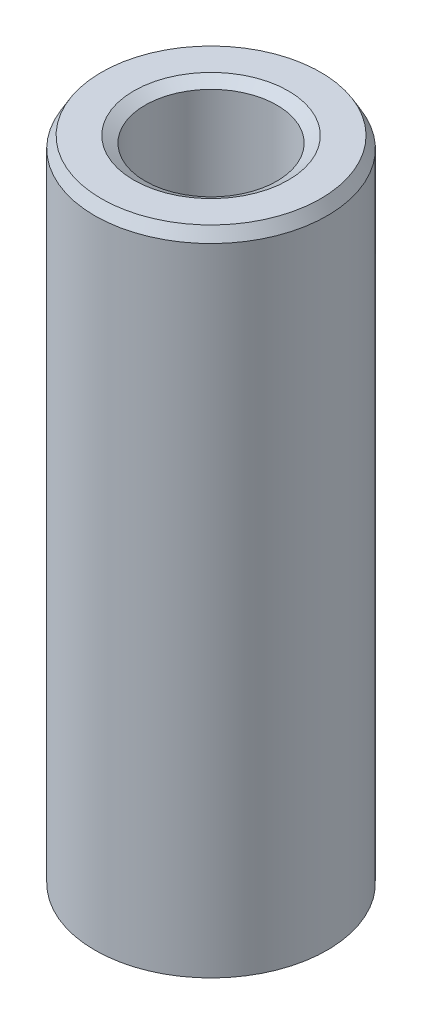
ISO-10303-21;
HEADER;
FILE_DESCRIPTION(('STEP AP214'),'2;1');
FILE_NAME('part.step','',(''),(''),'','','');
FILE_SCHEMA(('AUTOMOTIVE_DESIGN { 1 0 10303 214 1 1 1 1 }'));
ENDSEC;
DATA;
#1=APPLICATION_CONTEXT('core data for automotive mechanical design processes');
#2=APPLICATION_PROTOCOL_DEFINITION('international standard','automotive_design',2000,#1);
#3=PRODUCT_CONTEXT('',#1,'mechanical');
#4=PRODUCT('Part','Part','',(#3));
#5=PRODUCT_RELATED_PRODUCT_CATEGORY('part','',(#4));
#6=PRODUCT_DEFINITION_FORMATION('','',#4);
#7=PRODUCT_DEFINITION_CONTEXT('part definition',#1,'design');
#8=PRODUCT_DEFINITION('design','',#6,#7);
#9=PRODUCT_DEFINITION_SHAPE('','',#8);
#10=(LENGTH_UNIT() NAMED_UNIT(*) SI_UNIT(.MILLI.,.METRE.));
#11=(NAMED_UNIT(*) PLANE_ANGLE_UNIT() SI_UNIT($,.RADIAN.));
#12=(NAMED_UNIT(*) SI_UNIT($,.STERADIAN.) SOLID_ANGLE_UNIT());
#13=UNCERTAINTY_MEASURE_WITH_UNIT(LENGTH_MEASURE(1.E-05),#10,'distance_accuracy_value','');
#14=(GEOMETRIC_REPRESENTATION_CONTEXT(3) GLOBAL_UNCERTAINTY_ASSIGNED_CONTEXT((#13)) GLOBAL_UNIT_ASSIGNED_CONTEXT((#10,
#11,#12)) REPRESENTATION_CONTEXT('',''));
#15=CARTESIAN_POINT('',(0.,0.,0.));
#16=DIRECTION('',(0.,0.,1.));
#17=DIRECTION('',(1.,0.,0.));
#18=AXIS2_PLACEMENT_3D('',#15,#16,#17);
#19=CARTESIAN_POINT('',(0.,140.711096177235,0.));
#20=DIRECTION('',(0.,-1.,0.));
#21=DIRECTION('',(0.,0.,-1.));
#22=AXIS2_PLACEMENT_3D('',#19,#20,#21);
#23=CYLINDRICAL_SURFACE('',#22,25.);
#24=CARTESIAN_POINT('',(0.,1.42008506931526,0.));
#25=DIRECTION('',(0.,1.,0.));
#26=DIRECTION('',(0.,0.,1.));
#27=AXIS2_PLACEMENT_3D('',#24,#25,#26);
#28=CIRCLE('',#27,25.);
#29=CARTESIAN_POINT('',(0.,1.42008506931526,25.));
#30=VERTEX_POINT('',#29);
#31=EDGE_CURVE('E10',#30,#30,#28,.T.);
#32=ORIENTED_EDGE('',*,*,#31,.T.);
#33=EDGE_LOOP('',(#32));
#34=FACE_BOUND('',#33,.T.);
#35=CARTESIAN_POINT('',(0.,138.251436686111,0.));
#36=DIRECTION('',(0.,1.,0.));
#37=DIRECTION('',(0.,0.,1.));
#38=AXIS2_PLACEMENT_3D('',#35,#36,#37);
#39=CIRCLE('',#38,25.);
#40=CARTESIAN_POINT('',(0.,138.251436686111,25.));
#41=VERTEX_POINT('',#40);
#42=EDGE_CURVE('E50',#41,#41,#39,.F.);
#43=ORIENTED_EDGE('',*,*,#42,.T.);
#44=EDGE_LOOP('',(#43));
#45=FACE_BOUND('',#44,.T.);
#46=ADVANCED_FACE('F39',(#34,#45),#23,.T.);
#47=CARTESIAN_POINT('',(0.,140.711096177235,0.));
#48=DIRECTION('',(0.,1.,0.));
#49=DIRECTION('',(0.,0.,1.));
#50=AXIS2_PLACEMENT_3D('',#47,#48,#49);
#51=PLANE('',#50);
#52=CARTESIAN_POINT('',(0.,140.711096177235,0.));
#53=DIRECTION('',(0.,1.,0.));
#54=DIRECTION('',(0.,0.,1.));
#55=AXIS2_PLACEMENT_3D('',#52,#53,#54);
#56=CIRCLE('',#55,16.6314569226916);
#57=CARTESIAN_POINT('',(0.,140.711096177235,16.6314569226916));
#58=VERTEX_POINT('',#57);
#59=EDGE_CURVE('E58',#58,#58,#56,.F.);
#60=ORIENTED_EDGE('',*,*,#59,.T.);
#61=EDGE_LOOP('',(#60));
#62=FACE_BOUND('',#61,.T.);
#63=CARTESIAN_POINT('',(0.,140.711096177235,0.));
#64=DIRECTION('',(0.,1.,0.));
#65=DIRECTION('',(0.,0.,1.));
#66=AXIS2_PLACEMENT_3D('',#63,#64,#65);
#67=CIRCLE('',#66,23.5799149306848);
#68=CARTESIAN_POINT('',(0.,140.711096177235,23.5799149306848));
#69=VERTEX_POINT('',#68);
#70=EDGE_CURVE('E61',#69,#69,#67,.T.);
#71=ORIENTED_EDGE('',*,*,#70,.T.);
#72=EDGE_LOOP('',(#71));
#73=FACE_BOUND('',#72,.T.);
#74=ADVANCED_FACE('F88',(#62,#73),#51,.T.);
#75=CARTESIAN_POINT('',(0.,0.,0.));
#76=DIRECTION('',(0.,1.,0.));
#77=DIRECTION('',(0.,0.,1.));
#78=AXIS2_PLACEMENT_3D('',#75,#76,#77);
#79=PLANE('',#78);
#80=CARTESIAN_POINT('',(0.,0.,0.));
#81=DIRECTION('',(0.,1.,0.));
#82=DIRECTION('',(0.,0.,1.));
#83=AXIS2_PLACEMENT_3D('',#80,#81,#82);
#84=CIRCLE('',#83,15.5918825008829);
#85=CARTESIAN_POINT('',(0.,0.,15.5918825008829));
#86=VERTEX_POINT('',#85);
#87=EDGE_CURVE('E51',#86,#86,#84,.T.);
#88=ORIENTED_EDGE('',*,*,#87,.T.);
#89=EDGE_LOOP('',(#88));
#90=FACE_BOUND('',#89,.T.);
#91=CARTESIAN_POINT('',(0.,0.,0.));
#92=DIRECTION('',(0.,1.,0.));
#93=DIRECTION('',(0.,0.,1.));
#94=AXIS2_PLACEMENT_3D('',#91,#92,#93);
#95=CIRCLE('',#94,22.540340508876);
#96=CARTESIAN_POINT('',(0.,0.,22.540340508876));
#97=VERTEX_POINT('',#96);
#98=EDGE_CURVE('E54',#97,#97,#95,.F.);
#99=ORIENTED_EDGE('',*,*,#98,.T.);
#100=EDGE_LOOP('',(#99));
#101=FACE_BOUND('',#100,.T.);
#102=ADVANCED_FACE('F83',(#90,#101),#79,.F.);
#103=CARTESIAN_POINT('',(0.,140.711096177235,0.));
#104=DIRECTION('',(0.,-1.,0.));
#105=DIRECTION('',(0.,0.,-1.));
#106=AXIS2_PLACEMENT_3D('',#103,#104,#105);
#107=CYLINDRICAL_SURFACE('',#106,14.1717974315676);
#108=CARTESIAN_POINT('',(0.,139.29101110792,0.));
#109=DIRECTION('',(0.,1.,0.));
#110=DIRECTION('',(0.,0.,1.));
#111=AXIS2_PLACEMENT_3D('',#108,#109,#110);
#112=CIRCLE('',#111,14.1717974315676);
#113=CARTESIAN_POINT('',(0.,139.29101110792,14.1717974315676));
#114=VERTEX_POINT('',#113);
#115=EDGE_CURVE('E67',#114,#114,#112,.T.);
#116=ORIENTED_EDGE('',*,*,#115,.T.);
#117=EDGE_LOOP('',(#116));
#118=FACE_BOUND('',#117,.T.);
#119=CARTESIAN_POINT('',(0.,2.45965949112401,0.));
#120=DIRECTION('',(0.,1.,0.));
#121=DIRECTION('',(0.,0.,1.));
#122=AXIS2_PLACEMENT_3D('',#119,#120,#121);
#123=CIRCLE('',#122,14.1717974315676);
#124=CARTESIAN_POINT('',(0.,2.45965949112401,14.1717974315676));
#125=VERTEX_POINT('',#124);
#126=EDGE_CURVE('E69',#125,#125,#123,.F.);
#127=ORIENTED_EDGE('',*,*,#126,.T.);
#128=EDGE_LOOP('',(#127));
#129=FACE_BOUND('',#128,.T.);
#130=ADVANCED_FACE('F71',(#118,#129),#107,.F.);
#131=CARTESIAN_POINT('',(0.,139.29101110792,0.));
#132=DIRECTION('',(0.,1.,0.));
#133=DIRECTION('',(0.,0.,1.));
#134=AXIS2_PLACEMENT_3D('',#131,#132,#133);
#135=CONICAL_SURFACE('',#134,14.1717974315676,1.04719755119659);
#136=ORIENTED_EDGE('',*,*,#59,.F.);
#137=EDGE_LOOP('',(#136));
#138=FACE_BOUND('',#137,.T.);
#139=ORIENTED_EDGE('',*,*,#115,.F.);
#140=EDGE_LOOP('',(#139));
#141=FACE_BOUND('',#140,.T.);
#142=ADVANCED_FACE('F77',(#138,#141),#135,.F.);
#143=CARTESIAN_POINT('',(0.,0.,0.));
#144=DIRECTION('',(0.,-1.,0.));
#145=DIRECTION('',(0.,0.,-1.));
#146=AXIS2_PLACEMENT_3D('',#143,#144,#145);
#147=CONICAL_SURFACE('',#146,15.5918825008829,0.523598775598297);
#148=ORIENTED_EDGE('',*,*,#126,.F.);
#149=EDGE_LOOP('',(#148));
#150=FACE_BOUND('',#149,.T.);
#151=ORIENTED_EDGE('',*,*,#87,.F.);
#152=EDGE_LOOP('',(#151));
#153=FACE_BOUND('',#152,.T.);
#154=ADVANCED_FACE('F73',(#150,#153),#147,.F.);
#155=CARTESIAN_POINT('',(0.,1.42008506931526,0.));
#156=DIRECTION('',(0.,1.,0.));
#157=DIRECTION('',(0.,0.,1.));
#158=AXIS2_PLACEMENT_3D('',#155,#156,#157);
#159=CONICAL_SURFACE('',#158,25.,1.0471975511966);
#160=ORIENTED_EDGE('',*,*,#98,.F.);
#161=EDGE_LOOP('',(#160));
#162=FACE_BOUND('',#161,.T.);
#163=ORIENTED_EDGE('',*,*,#31,.F.);
#164=EDGE_LOOP('',(#163));
#165=FACE_BOUND('',#164,.T.);
#166=ADVANCED_FACE('F76',(#162,#165),#159,.T.);
#167=CARTESIAN_POINT('',(0.,140.711096177235,0.));
#168=DIRECTION('',(0.,-1.,0.));
#169=DIRECTION('',(0.,0.,-1.));
#170=AXIS2_PLACEMENT_3D('',#167,#168,#169);
#171=CONICAL_SURFACE('',#170,23.5799149306848,0.523598775598293);
#172=ORIENTED_EDGE('',*,*,#42,.F.);
#173=EDGE_LOOP('',(#172));
#174=FACE_BOUND('',#173,.T.);
#175=ORIENTED_EDGE('',*,*,#70,.F.);
#176=EDGE_LOOP('',(#175));
#177=FACE_BOUND('',#176,.T.);
#178=ADVANCED_FACE('F45',(#174,#177),#171,.T.);
#179=CLOSED_SHELL('',(#46,#74,#102,#130,#142,#154,#166,#178));
#180=MANIFOLD_SOLID_BREP('B2',#179);
#181=ADVANCED_BREP_SHAPE_REPRESENTATION('',(#18,#180),#14);
#182=SHAPE_DEFINITION_REPRESENTATION(#9,#181);
ENDSEC;
END-ISO-10303-21;
